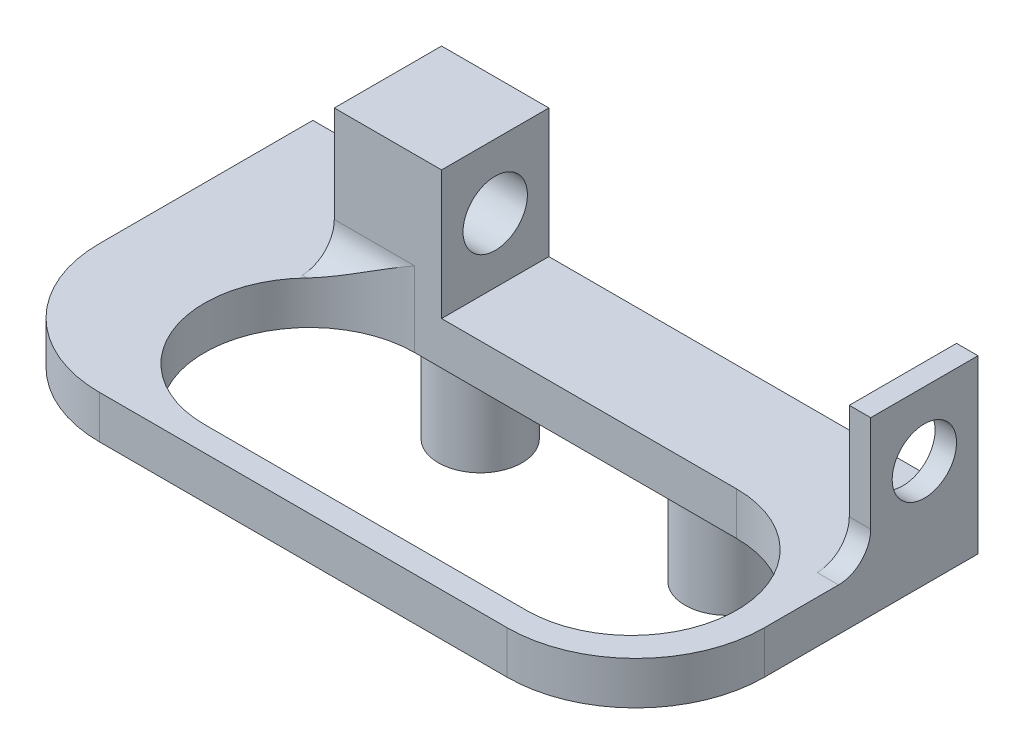
ISO-10303-21;
HEADER;
FILE_DESCRIPTION(('STEP AP214'),'2;1');
FILE_NAME('part.step','',(''),(''),'','','');
FILE_SCHEMA(('AUTOMOTIVE_DESIGN { 1 0 10303 214 1 1 1 1 }'));
ENDSEC;
DATA;
#1=APPLICATION_CONTEXT('core data for automotive mechanical design processes');
#2=APPLICATION_PROTOCOL_DEFINITION('international standard','automotive_design',2000,#1);
#3=PRODUCT_CONTEXT('',#1,'mechanical');
#4=PRODUCT('Part','Part','',(#3));
#5=PRODUCT_RELATED_PRODUCT_CATEGORY('part','',(#4));
#6=PRODUCT_DEFINITION_FORMATION('','',#4);
#7=PRODUCT_DEFINITION_CONTEXT('part definition',#1,'design');
#8=PRODUCT_DEFINITION('design','',#6,#7);
#9=PRODUCT_DEFINITION_SHAPE('','',#8);
#10=(LENGTH_UNIT() NAMED_UNIT(*) SI_UNIT(.MILLI.,.METRE.));
#11=(NAMED_UNIT(*) PLANE_ANGLE_UNIT() SI_UNIT($,.RADIAN.));
#12=(NAMED_UNIT(*) SI_UNIT($,.STERADIAN.) SOLID_ANGLE_UNIT());
#13=UNCERTAINTY_MEASURE_WITH_UNIT(LENGTH_MEASURE(1.E-05),#10,'distance_accuracy_value','');
#14=(GEOMETRIC_REPRESENTATION_CONTEXT(3) GLOBAL_UNCERTAINTY_ASSIGNED_CONTEXT((#13)) GLOBAL_UNIT_ASSIGNED_CONTEXT((#10,
#11,#12)) REPRESENTATION_CONTEXT('',''));
#15=CARTESIAN_POINT('',(0.,0.,0.));
#16=DIRECTION('',(0.,0.,1.));
#17=DIRECTION('',(1.,0.,0.));
#18=AXIS2_PLACEMENT_3D('',#15,#16,#17);
#19=CARTESIAN_POINT('',(0.,2.,0.));
#20=DIRECTION('',(0.,1.,0.));
#21=DIRECTION('',(0.,0.,1.));
#22=AXIS2_PLACEMENT_3D('',#19,#20,#21);
#23=PLANE('',#22);
#24=DIRECTION('',(0.,0.,-1.));
#25=VECTOR('',#24,1.);
#26=CARTESIAN_POINT('',(21.25,2.,-1.95));
#27=LINE('',#26,#25);
#28=CARTESIAN_POINT('',(21.25,2.,8.));
#29=VERTEX_POINT('',#28);
#30=CARTESIAN_POINT('',(21.25,2.,4.55));
#31=VERTEX_POINT('',#30);
#32=EDGE_CURVE('E372',#29,#31,#27,.T.);
#33=ORIENTED_EDGE('',*,*,#32,.T.);
#34=DIRECTION('',(1.,0.,0.));
#35=VECTOR('',#34,1.);
#36=CARTESIAN_POINT('',(0.,2.,4.55000000000001));
#37=LINE('',#36,#35);
#38=CARTESIAN_POINT('',(20.25,2.,4.55));
#39=VERTEX_POINT('',#38);
#40=EDGE_CURVE('E444',#31,#39,#37,.F.);
#41=ORIENTED_EDGE('',*,*,#40,.T.);
#42=DIRECTION('',(0.,0.,1.));
#43=VECTOR('',#42,1.);
#44=CARTESIAN_POINT('',(20.25,2.,-1.95));
#45=LINE('',#44,#43);
#46=CARTESIAN_POINT('',(20.25,2.,-1.95));
#47=VERTEX_POINT('',#46);
#48=EDGE_CURVE('E227',#47,#39,#45,.T.);
#49=ORIENTED_EDGE('',*,*,#48,.F.);
#50=DIRECTION('',(-1.,0.,0.));
#51=VECTOR('',#50,1.);
#52=CARTESIAN_POINT('',(-9.75,2.,-1.95));
#53=LINE('',#52,#51);
#54=CARTESIAN_POINT('',(1.25,2.,-1.95));
#55=VERTEX_POINT('',#54);
#56=EDGE_CURVE('E377',#47,#55,#53,.T.);
#57=ORIENTED_EDGE('',*,*,#56,.T.);
#58=DIRECTION('',(0.,0.,-1.));
#59=VECTOR('',#58,1.);
#60=CARTESIAN_POINT('',(1.25,2.,-1.95));
#61=LINE('',#60,#59);
#62=CARTESIAN_POINT('',(1.25,2.,3.05));
#63=VERTEX_POINT('',#62);
#64=EDGE_CURVE('E248',#63,#55,#61,.T.);
#65=ORIENTED_EDGE('',*,*,#64,.F.);
#66=DIRECTION('',(1.,0.,0.));
#67=VECTOR('',#66,1.);
#68=CARTESIAN_POINT('',(0.,2.,3.05));
#69=LINE('',#68,#67);
#70=CARTESIAN_POINT('',(15.,2.,3.05));
#71=VERTEX_POINT('',#70);
#72=EDGE_CURVE('E318',#63,#71,#69,.T.);
#73=ORIENTED_EDGE('',*,*,#72,.T.);
#74=CARTESIAN_POINT('',(15.,2.,7.95));
#75=DIRECTION('',(0.,-1.,0.));
#76=DIRECTION('',(0.,0.,-1.));
#77=AXIS2_PLACEMENT_3D('',#74,#75,#76);
#78=CIRCLE('',#77,4.9);
#79=CARTESIAN_POINT('',(15.,2.,12.85));
#80=VERTEX_POINT('',#79);
#81=EDGE_CURVE('E322',#71,#80,#78,.T.);
#82=ORIENTED_EDGE('',*,*,#81,.T.);
#83=DIRECTION('',(-1.,0.,0.));
#84=VECTOR('',#83,1.);
#85=CARTESIAN_POINT('',(0.,2.,12.85));
#86=LINE('',#85,#84);
#87=CARTESIAN_POINT('',(0.,2.,12.85));
#88=VERTEX_POINT('',#87);
#89=EDGE_CURVE('E326',#80,#88,#86,.T.);
#90=ORIENTED_EDGE('',*,*,#89,.T.);
#91=CARTESIAN_POINT('',(0.,2.,7.95));
#92=DIRECTION('',(0.,-1.,0.));
#93=DIRECTION('',(0.,0.,-1.));
#94=AXIS2_PLACEMENT_3D('',#91,#92,#93);
#95=CIRCLE('',#94,4.9);
#96=CARTESIAN_POINT('',(-3.52845575287547,2.,4.55));
#97=VERTEX_POINT('',#96);
#98=EDGE_CURVE('E314',#88,#97,#95,.T.);
#99=ORIENTED_EDGE('',*,*,#98,.T.);
#100=DIRECTION('',(1.,0.,0.));
#101=VECTOR('',#100,1.);
#102=CARTESIAN_POINT('',(0.,2.,4.55));
#103=LINE('',#102,#101);
#104=CARTESIAN_POINT('',(-3.75,2.,4.55));
#105=VERTEX_POINT('',#104);
#106=EDGE_CURVE('E440',#97,#105,#103,.F.);
#107=ORIENTED_EDGE('',*,*,#106,.T.);
#108=DIRECTION('',(0.,0.,1.));
#109=VECTOR('',#108,1.);
#110=CARTESIAN_POINT('',(-3.75,2.,-1.95));
#111=LINE('',#110,#109);
#112=CARTESIAN_POINT('',(-3.75,2.,-1.95));
#113=VERTEX_POINT('',#112);
#114=EDGE_CURVE('E254',#113,#105,#111,.T.);
#115=ORIENTED_EDGE('',*,*,#114,.F.);
#116=CARTESIAN_POINT('',(-9.75,2.,-1.95));
#117=VERTEX_POINT('',#116);
#118=EDGE_CURVE('E376',#113,#117,#53,.T.);
#119=ORIENTED_EDGE('',*,*,#118,.T.);
#120=DIRECTION('',(0.,0.,1.));
#121=VECTOR('',#120,1.);
#122=CARTESIAN_POINT('',(-9.75,2.,-1.95));
#123=LINE('',#122,#121);
#124=CARTESIAN_POINT('',(-9.75,2.,8.));
#125=VERTEX_POINT('',#124);
#126=EDGE_CURVE('E363',#117,#125,#123,.T.);
#127=ORIENTED_EDGE('',*,*,#126,.T.);
#128=CARTESIAN_POINT('',(-3.75,2.,8.));
#129=DIRECTION('',(0.,1.,0.));
#130=DIRECTION('',(0.,0.,1.));
#131=AXIS2_PLACEMENT_3D('',#128,#129,#130);
#132=CIRCLE('',#131,6.);
#133=CARTESIAN_POINT('',(-3.75,2.,14.));
#134=VERTEX_POINT('',#133);
#135=EDGE_CURVE('E421',#125,#134,#132,.T.);
#136=ORIENTED_EDGE('',*,*,#135,.T.);
#137=DIRECTION('',(1.,0.,0.));
#138=VECTOR('',#137,1.);
#139=CARTESIAN_POINT('',(-9.75,2.,14.));
#140=LINE('',#139,#138);
#141=CARTESIAN_POINT('',(15.25,2.,14.));
#142=VERTEX_POINT('',#141);
#143=EDGE_CURVE('E367',#134,#142,#140,.T.);
#144=ORIENTED_EDGE('',*,*,#143,.T.);
#145=CARTESIAN_POINT('',(15.25,2.,8.));
#146=DIRECTION('',(0.,1.,0.));
#147=DIRECTION('',(0.,0.,1.));
#148=AXIS2_PLACEMENT_3D('',#145,#146,#147);
#149=CIRCLE('',#148,6.);
#150=EDGE_CURVE('E418',#142,#29,#149,.T.);
#151=ORIENTED_EDGE('',*,*,#150,.T.);
#152=EDGE_LOOP('',(#33,#41,#49,#57,#65,#73,#82,#90,#99,#107,#115,#119,#127,#136,#144,#151));
#153=FACE_BOUND('',#152,.T.);
#154=ADVANCED_FACE('F39',(#153),#23,.T.);
#155=CARTESIAN_POINT('',(0.,0.,0.));
#156=DIRECTION('',(0.,1.,0.));
#157=DIRECTION('',(0.,0.,1.));
#158=AXIS2_PLACEMENT_3D('',#155,#156,#157);
#159=PLANE('',#158);
#160=DIRECTION('',(1.,0.,0.));
#161=VECTOR('',#160,1.);
#162=CARTESIAN_POINT('',(0.,0.,3.05));
#163=LINE('',#162,#161);
#164=CARTESIAN_POINT('',(0.,0.,3.05));
#165=VERTEX_POINT('',#164);
#166=CARTESIAN_POINT('',(15.,0.,3.05));
#167=VERTEX_POINT('',#166);
#168=EDGE_CURVE('E332',#165,#167,#163,.T.);
#169=ORIENTED_EDGE('',*,*,#168,.F.);
#170=CARTESIAN_POINT('',(0.,0.,7.95));
#171=DIRECTION('',(0.,-1.,0.));
#172=DIRECTION('',(0.,0.,-1.));
#173=AXIS2_PLACEMENT_3D('',#170,#171,#172);
#174=CIRCLE('',#173,4.9);
#175=CARTESIAN_POINT('',(0.,0.,12.85));
#176=VERTEX_POINT('',#175);
#177=EDGE_CURVE('E313',#176,#165,#174,.T.);
#178=ORIENTED_EDGE('',*,*,#177,.F.);
#179=DIRECTION('',(-1.,0.,0.));
#180=VECTOR('',#179,1.);
#181=CARTESIAN_POINT('',(0.,0.,12.85));
#182=LINE('',#181,#180);
#183=CARTESIAN_POINT('',(15.,0.,12.85));
#184=VERTEX_POINT('',#183);
#185=EDGE_CURVE('E319',#184,#176,#182,.T.);
#186=ORIENTED_EDGE('',*,*,#185,.F.);
#187=CARTESIAN_POINT('',(15.,0.,7.95));
#188=DIRECTION('',(0.,-1.,0.));
#189=DIRECTION('',(0.,0.,-1.));
#190=AXIS2_PLACEMENT_3D('',#187,#188,#189);
#191=CIRCLE('',#190,4.9);
#192=EDGE_CURVE('E336',#167,#184,#191,.T.);
#193=ORIENTED_EDGE('',*,*,#192,.F.);
#194=EDGE_LOOP('',(#169,#178,#186,#193));
#195=FACE_BOUND('',#194,.T.);
#196=DIRECTION('',(-1.,0.,0.));
#197=VECTOR('',#196,1.);
#198=CARTESIAN_POINT('',(0.,0.,1.95));
#199=LINE('',#198,#197);
#200=CARTESIAN_POINT('',(11.5,0.,1.95));
#201=VERTEX_POINT('',#200);
#202=CARTESIAN_POINT('',(0.,0.,1.95));
#203=VERTEX_POINT('',#202);
#204=EDGE_CURVE('E283',#201,#203,#199,.T.);
#205=ORIENTED_EDGE('',*,*,#204,.F.);
#206=CARTESIAN_POINT('',(11.5,0.,0.));
#207=DIRECTION('',(0.,1.,0.));
#208=DIRECTION('',(0.,0.,1.));
#209=AXIS2_PLACEMENT_3D('',#206,#207,#208);
#210=CIRCLE('',#209,1.95);
#211=CARTESIAN_POINT('',(11.5,0.,-1.95));
#212=VERTEX_POINT('',#211);
#213=EDGE_CURVE('E346',#201,#212,#210,.T.);
#214=ORIENTED_EDGE('',*,*,#213,.T.);
#215=DIRECTION('',(-1.,0.,0.));
#216=VECTOR('',#215,1.);
#217=CARTESIAN_POINT('',(-9.75,0.,-1.95));
#218=LINE('',#217,#216);
#219=CARTESIAN_POINT('',(21.25,0.,-1.95));
#220=VERTEX_POINT('',#219);
#221=EDGE_CURVE('E368',#220,#212,#218,.T.);
#222=ORIENTED_EDGE('',*,*,#221,.F.);
#223=DIRECTION('',(0.,0.,-1.));
#224=VECTOR('',#223,1.);
#225=CARTESIAN_POINT('',(21.25,0.,-1.95));
#226=LINE('',#225,#224);
#227=CARTESIAN_POINT('',(21.25,0.,8.));
#228=VERTEX_POINT('',#227);
#229=EDGE_CURVE('E204',#228,#220,#226,.T.);
#230=ORIENTED_EDGE('',*,*,#229,.F.);
#231=CARTESIAN_POINT('',(15.25,0.,8.));
#232=DIRECTION('',(0.,1.,0.));
#233=DIRECTION('',(0.,0.,1.));
#234=AXIS2_PLACEMENT_3D('',#231,#232,#233);
#235=CIRCLE('',#234,6.);
#236=CARTESIAN_POINT('',(15.25,0.,14.));
#237=VERTEX_POINT('',#236);
#238=EDGE_CURVE('E409',#228,#237,#235,.F.);
#239=ORIENTED_EDGE('',*,*,#238,.T.);
#240=DIRECTION('',(1.,0.,0.));
#241=VECTOR('',#240,1.);
#242=CARTESIAN_POINT('',(-9.75,0.,14.));
#243=LINE('',#242,#241);
#244=CARTESIAN_POINT('',(-3.75,0.,14.));
#245=VERTEX_POINT('',#244);
#246=EDGE_CURVE('E383',#245,#237,#243,.T.);
#247=ORIENTED_EDGE('',*,*,#246,.F.);
#248=CARTESIAN_POINT('',(-3.75,0.,8.));
#249=DIRECTION('',(0.,1.,0.));
#250=DIRECTION('',(0.,0.,1.));
#251=AXIS2_PLACEMENT_3D('',#248,#249,#250);
#252=CIRCLE('',#251,6.);
#253=CARTESIAN_POINT('',(-9.75,0.,8.));
#254=VERTEX_POINT('',#253);
#255=EDGE_CURVE('E412',#245,#254,#252,.F.);
#256=ORIENTED_EDGE('',*,*,#255,.T.);
#257=DIRECTION('',(0.,0.,1.));
#258=VECTOR('',#257,1.);
#259=CARTESIAN_POINT('',(-9.75,0.,-1.95));
#260=LINE('',#259,#258);
#261=CARTESIAN_POINT('',(-9.75,0.,-1.95));
#262=VERTEX_POINT('',#261);
#263=EDGE_CURVE('E359',#262,#254,#260,.T.);
#264=ORIENTED_EDGE('',*,*,#263,.F.);
#265=CARTESIAN_POINT('',(0.,0.,-1.95));
#266=VERTEX_POINT('',#265);
#267=EDGE_CURVE('E389',#266,#262,#218,.T.);
#268=ORIENTED_EDGE('',*,*,#267,.F.);
#269=CARTESIAN_POINT('',(0.,0.,0.));
#270=DIRECTION('',(0.,1.,0.));
#271=DIRECTION('',(0.,0.,1.));
#272=AXIS2_PLACEMENT_3D('',#269,#270,#271);
#273=CIRCLE('',#272,1.95);
#274=EDGE_CURVE('E209',#266,#203,#273,.T.);
#275=ORIENTED_EDGE('',*,*,#274,.T.);
#276=EDGE_LOOP('',(#205,#214,#222,#230,#239,#247,#256,#264,#268,#275));
#277=FACE_BOUND('',#276,.T.);
#278=ADVANCED_FACE('F481',(#195,#277),#159,.F.);
#279=CARTESIAN_POINT('',(0.,-5.,0.));
#280=DIRECTION('',(0.,1.,0.));
#281=DIRECTION('',(0.,0.,1.));
#282=AXIS2_PLACEMENT_3D('',#279,#280,#281);
#283=CYLINDRICAL_SURFACE('',#282,1.95);
#284=CARTESIAN_POINT('',(0.,-1.,0.));
#285=DIRECTION('',(0.,-1.,0.));
#286=DIRECTION('',(0.,0.,-1.));
#287=AXIS2_PLACEMENT_3D('',#284,#285,#286);
#288=CIRCLE('',#287,1.95);
#289=CARTESIAN_POINT('',(0.,-1.,1.95));
#290=VERTEX_POINT('',#289);
#291=CARTESIAN_POINT('',(0.,-1.,-1.95));
#292=VERTEX_POINT('',#291);
#293=EDGE_CURVE('E309',#290,#292,#288,.F.);
#294=ORIENTED_EDGE('',*,*,#293,.F.);
#295=DIRECTION('',(0.,1.,0.));
#296=VECTOR('',#295,1.);
#297=CARTESIAN_POINT('',(0.,-1.,1.95));
#298=LINE('',#297,#296);
#299=EDGE_CURVE('E292',#290,#203,#298,.T.);
#300=ORIENTED_EDGE('',*,*,#299,.T.);
#301=ORIENTED_EDGE('',*,*,#274,.F.);
#302=DIRECTION('',(0.,1.,0.));
#303=VECTOR('',#302,1.);
#304=CARTESIAN_POINT('',(0.,-1.,-1.95));
#305=LINE('',#304,#303);
#306=EDGE_CURVE('E305',#292,#266,#305,.T.);
#307=ORIENTED_EDGE('',*,*,#306,.F.);
#308=EDGE_LOOP('',(#294,#300,#301,#307));
#309=FACE_BOUND('',#308,.T.);
#310=CARTESIAN_POINT('',(0.,-5.,0.));
#311=DIRECTION('',(0.,1.,0.));
#312=DIRECTION('',(0.,0.,1.));
#313=AXIS2_PLACEMENT_3D('',#310,#311,#312);
#314=CIRCLE('',#313,1.95);
#315=CARTESIAN_POINT('',(0.,-5.,1.95));
#316=VERTEX_POINT('',#315);
#317=EDGE_CURVE('E395',#316,#316,#314,.T.);
#318=ORIENTED_EDGE('',*,*,#317,.T.);
#319=EDGE_LOOP('',(#318));
#320=FACE_BOUND('',#319,.T.);
#321=ADVANCED_FACE('F485',(#309,#320),#283,.T.);
#322=CARTESIAN_POINT('',(0.,-5.,0.));
#323=DIRECTION('',(0.,1.,0.));
#324=DIRECTION('',(0.,0.,1.));
#325=AXIS2_PLACEMENT_3D('',#322,#323,#324);
#326=PLANE('',#325);
#327=ORIENTED_EDGE('',*,*,#317,.F.);
#328=EDGE_LOOP('',(#327));
#329=FACE_BOUND('',#328,.T.);
#330=ADVANCED_FACE('F499',(#329),#326,.F.);
#331=CARTESIAN_POINT('',(-9.75,2.,-1.95));
#332=DIRECTION('',(1.,0.,0.));
#333=DIRECTION('',(0.,0.,-1.));
#334=AXIS2_PLACEMENT_3D('',#331,#332,#333);
#335=PLANE('',#334);
#336=ORIENTED_EDGE('',*,*,#263,.T.);
#337=DIRECTION('',(0.,-1.,0.));
#338=VECTOR('',#337,1.);
#339=CARTESIAN_POINT('',(-9.75,2.,8.));
#340=LINE('',#339,#338);
#341=EDGE_CURVE('E415',#254,#125,#340,.F.);
#342=ORIENTED_EDGE('',*,*,#341,.T.);
#343=ORIENTED_EDGE('',*,*,#126,.F.);
#344=DIRECTION('',(0.,-1.,0.));
#345=VECTOR('',#344,1.);
#346=CARTESIAN_POINT('',(-9.75,2.,-1.95));
#347=LINE('',#346,#345);
#348=EDGE_CURVE('E210',#117,#262,#347,.T.);
#349=ORIENTED_EDGE('',*,*,#348,.T.);
#350=EDGE_LOOP('',(#336,#342,#343,#349));
#351=FACE_BOUND('',#350,.T.);
#352=ADVANCED_FACE('F495',(#351),#335,.F.);
#353=CARTESIAN_POINT('',(-9.75,2.,14.));
#354=DIRECTION('',(0.,0.,-1.));
#355=DIRECTION('',(-1.,0.,0.));
#356=AXIS2_PLACEMENT_3D('',#353,#354,#355);
#357=PLANE('',#356);
#358=ORIENTED_EDGE('',*,*,#143,.F.);
#359=DIRECTION('',(0.,-1.,0.));
#360=VECTOR('',#359,1.);
#361=CARTESIAN_POINT('',(-3.75,2.,14.));
#362=LINE('',#361,#360);
#363=EDGE_CURVE('E405',#134,#245,#362,.T.);
#364=ORIENTED_EDGE('',*,*,#363,.T.);
#365=ORIENTED_EDGE('',*,*,#246,.T.);
#366=DIRECTION('',(0.,-1.,0.));
#367=VECTOR('',#366,1.);
#368=CARTESIAN_POINT('',(15.25,2.,14.));
#369=LINE('',#368,#367);
#370=EDGE_CURVE('E399',#237,#142,#369,.F.);
#371=ORIENTED_EDGE('',*,*,#370,.T.);
#372=EDGE_LOOP('',(#358,#364,#365,#371));
#373=FACE_BOUND('',#372,.T.);
#374=ADVANCED_FACE('F491',(#373),#357,.F.);
#375=CARTESIAN_POINT('',(21.25,2.,-1.95));
#376=DIRECTION('',(-1.,0.,0.));
#377=DIRECTION('',(0.,0.,1.));
#378=AXIS2_PLACEMENT_3D('',#375,#376,#377);
#379=PLANE('',#378);
#380=CARTESIAN_POINT('',(21.25,5.,0.549999999999997));
#381=DIRECTION('',(-1.,0.,0.));
#382=DIRECTION('',(0.,0.,1.));
#383=AXIS2_PLACEMENT_3D('',#380,#381,#382);
#384=CIRCLE('',#383,1.5);
#385=CARTESIAN_POINT('',(21.25,5.,2.05));
#386=VERTEX_POINT('',#385);
#387=EDGE_CURVE('E436',#386,#386,#384,.T.);
#388=ORIENTED_EDGE('',*,*,#387,.T.);
#389=EDGE_LOOP('',(#388));
#390=FACE_BOUND('',#389,.T.);
#391=ORIENTED_EDGE('',*,*,#32,.F.);
#392=DIRECTION('',(0.,-1.,0.));
#393=VECTOR('',#392,1.);
#394=CARTESIAN_POINT('',(21.25,2.,8.));
#395=LINE('',#394,#393);
#396=EDGE_CURVE('E424',#29,#228,#395,.T.);
#397=ORIENTED_EDGE('',*,*,#396,.T.);
#398=ORIENTED_EDGE('',*,*,#229,.T.);
#399=DIRECTION('',(0.,-1.,0.));
#400=VECTOR('',#399,1.);
#401=CARTESIAN_POINT('',(21.25,2.,-1.95));
#402=LINE('',#401,#400);
#403=CARTESIAN_POINT('',(21.25,8.,-1.95));
#404=VERTEX_POINT('',#403);
#405=EDGE_CURVE('E195',#404,#220,#402,.T.);
#406=ORIENTED_EDGE('',*,*,#405,.F.);
#407=DIRECTION('',(0.,0.,-1.));
#408=VECTOR('',#407,1.);
#409=CARTESIAN_POINT('',(21.25,8.,-1.95));
#410=LINE('',#409,#408);
#411=CARTESIAN_POINT('',(21.25,8.,3.05));
#412=VERTEX_POINT('',#411);
#413=EDGE_CURVE('E201',#412,#404,#410,.T.);
#414=ORIENTED_EDGE('',*,*,#413,.F.);
#415=DIRECTION('',(0.,-1.,0.));
#416=VECTOR('',#415,1.);
#417=CARTESIAN_POINT('',(21.25,8.,3.05));
#418=LINE('',#417,#416);
#419=CARTESIAN_POINT('',(21.25,3.5,3.05));
#420=VERTEX_POINT('',#419);
#421=EDGE_CURVE('E238',#412,#420,#418,.T.);
#422=ORIENTED_EDGE('',*,*,#421,.T.);
#423=CARTESIAN_POINT('',(21.25,3.5,4.55));
#424=DIRECTION('',(-1.,0.,0.));
#425=DIRECTION('',(0.,0.,1.));
#426=AXIS2_PLACEMENT_3D('',#423,#424,#425);
#427=CIRCLE('',#426,1.5);
#428=EDGE_CURVE('E452',#420,#31,#427,.T.);
#429=ORIENTED_EDGE('',*,*,#428,.T.);
#430=EDGE_LOOP('',(#391,#397,#398,#406,#414,#422,#429));
#431=FACE_BOUND('',#430,.T.);
#432=ADVANCED_FACE('F198',(#390,#431),#379,.F.);
#433=CARTESIAN_POINT('',(-9.75,2.,-1.95));
#434=DIRECTION('',(0.,0.,1.));
#435=DIRECTION('',(1.,0.,0.));
#436=AXIS2_PLACEMENT_3D('',#433,#434,#435);
#437=PLANE('',#436);
#438=ORIENTED_EDGE('',*,*,#221,.T.);
#439=DIRECTION('',(0.,1.,0.));
#440=VECTOR('',#439,1.);
#441=CARTESIAN_POINT('',(11.5,-1.,-1.95));
#442=LINE('',#441,#440);
#443=CARTESIAN_POINT('',(11.5,-1.,-1.95));
#444=VERTEX_POINT('',#443);
#445=EDGE_CURVE('E302',#444,#212,#442,.T.);
#446=ORIENTED_EDGE('',*,*,#445,.F.);
#447=DIRECTION('',(1.,0.,0.));
#448=VECTOR('',#447,1.);
#449=CARTESIAN_POINT('',(0.,-1.,-1.95));
#450=LINE('',#449,#448);
#451=EDGE_CURVE('E284',#292,#444,#450,.T.);
#452=ORIENTED_EDGE('',*,*,#451,.F.);
#453=ORIENTED_EDGE('',*,*,#306,.T.);
#454=ORIENTED_EDGE('',*,*,#267,.T.);
#455=ORIENTED_EDGE('',*,*,#348,.F.);
#456=ORIENTED_EDGE('',*,*,#118,.F.);
#457=DIRECTION('',(0.,-1.,0.));
#458=VECTOR('',#457,1.);
#459=CARTESIAN_POINT('',(-3.75,8.,-1.95));
#460=LINE('',#459,#458);
#461=CARTESIAN_POINT('',(-3.75,8.,-1.95));
#462=VERTEX_POINT('',#461);
#463=EDGE_CURVE('E275',#462,#113,#460,.T.);
#464=ORIENTED_EDGE('',*,*,#463,.F.);
#465=DIRECTION('',(-1.,0.,0.));
#466=VECTOR('',#465,1.);
#467=CARTESIAN_POINT('',(-3.75,8.,-1.95));
#468=LINE('',#467,#466);
#469=CARTESIAN_POINT('',(1.25,8.,-1.95));
#470=VERTEX_POINT('',#469);
#471=EDGE_CURVE('E253',#470,#462,#468,.T.);
#472=ORIENTED_EDGE('',*,*,#471,.F.);
#473=DIRECTION('',(0.,-1.,0.));
#474=VECTOR('',#473,1.);
#475=CARTESIAN_POINT('',(1.25,8.,-1.95));
#476=LINE('',#475,#474);
#477=EDGE_CURVE('E279',#470,#55,#476,.T.);
#478=ORIENTED_EDGE('',*,*,#477,.T.);
#479=ORIENTED_EDGE('',*,*,#56,.F.);
#480=DIRECTION('',(0.,-1.,0.));
#481=VECTOR('',#480,1.);
#482=CARTESIAN_POINT('',(20.25,8.,-1.95));
#483=LINE('',#482,#481);
#484=CARTESIAN_POINT('',(20.25,8.,-1.95));
#485=VERTEX_POINT('',#484);
#486=EDGE_CURVE('E216',#485,#47,#483,.T.);
#487=ORIENTED_EDGE('',*,*,#486,.F.);
#488=DIRECTION('',(-1.,0.,0.));
#489=VECTOR('',#488,1.);
#490=CARTESIAN_POINT('',(21.25,8.,-1.95));
#491=LINE('',#490,#489);
#492=EDGE_CURVE('E213',#404,#485,#491,.T.);
#493=ORIENTED_EDGE('',*,*,#492,.F.);
#494=ORIENTED_EDGE('',*,*,#405,.T.);
#495=EDGE_LOOP('',(#438,#446,#452,#453,#454,#455,#456,#464,#472,#478,#479,#487,#493,#494));
#496=FACE_BOUND('',#495,.T.);
#497=ADVANCED_FACE('F214',(#496),#437,.F.);
#498=CARTESIAN_POINT('',(11.5,-5.,0.));
#499=DIRECTION('',(0.,1.,0.));
#500=DIRECTION('',(0.,0.,1.));
#501=AXIS2_PLACEMENT_3D('',#498,#499,#500);
#502=CYLINDRICAL_SURFACE('',#501,1.95);
#503=CARTESIAN_POINT('',(11.5,-1.,0.));
#504=DIRECTION('',(0.,-1.,0.));
#505=DIRECTION('',(0.,0.,-1.));
#506=AXIS2_PLACEMENT_3D('',#503,#504,#505);
#507=CIRCLE('',#506,1.95);
#508=CARTESIAN_POINT('',(11.5,-1.,1.95));
#509=VERTEX_POINT('',#508);
#510=EDGE_CURVE('E427',#444,#509,#507,.F.);
#511=ORIENTED_EDGE('',*,*,#510,.F.);
#512=ORIENTED_EDGE('',*,*,#445,.T.);
#513=ORIENTED_EDGE('',*,*,#213,.F.);
#514=DIRECTION('',(0.,1.,0.));
#515=VECTOR('',#514,1.);
#516=CARTESIAN_POINT('',(11.5,-1.,1.95));
#517=LINE('',#516,#515);
#518=EDGE_CURVE('E298',#509,#201,#517,.T.);
#519=ORIENTED_EDGE('',*,*,#518,.F.);
#520=EDGE_LOOP('',(#511,#512,#513,#519));
#521=FACE_BOUND('',#520,.T.);
#522=CARTESIAN_POINT('',(11.5,-5.,0.));
#523=DIRECTION('',(0.,1.,0.));
#524=DIRECTION('',(0.,0.,1.));
#525=AXIS2_PLACEMENT_3D('',#522,#523,#524);
#526=CIRCLE('',#525,1.95);
#527=CARTESIAN_POINT('',(11.5,-5.,1.95));
#528=VERTEX_POINT('',#527);
#529=EDGE_CURVE('E355',#528,#528,#526,.T.);
#530=ORIENTED_EDGE('',*,*,#529,.T.);
#531=EDGE_LOOP('',(#530));
#532=FACE_BOUND('',#531,.T.);
#533=ADVANCED_FACE('F474',(#521,#532),#502,.T.);
#534=CARTESIAN_POINT('',(11.5,-5.,0.));
#535=DIRECTION('',(0.,1.,0.));
#536=DIRECTION('',(0.,0.,1.));
#537=AXIS2_PLACEMENT_3D('',#534,#535,#536);
#538=PLANE('',#537);
#539=ORIENTED_EDGE('',*,*,#529,.F.);
#540=EDGE_LOOP('',(#539));
#541=FACE_BOUND('',#540,.T.);
#542=ADVANCED_FACE('F469',(#541),#538,.F.);
#543=CARTESIAN_POINT('',(0.,2.,7.95));
#544=DIRECTION('',(0.,-1.,0.));
#545=DIRECTION('',(0.,0.,-1.));
#546=AXIS2_PLACEMENT_3D('',#543,#544,#545);
#547=CYLINDRICAL_SURFACE('',#546,4.9);
#548=ORIENTED_EDGE('',*,*,#177,.T.);
#549=DIRECTION('',(0.,-1.,0.));
#550=VECTOR('',#549,1.);
#551=CARTESIAN_POINT('',(0.,2.,3.05));
#552=LINE('',#551,#550);
#553=CARTESIAN_POINT('',(0.,3.5,3.05));
#554=VERTEX_POINT('',#553);
#555=EDGE_CURVE('E56',#554,#165,#552,.T.);
#556=ORIENTED_EDGE('',*,*,#555,.F.);
#557=CARTESIAN_POINT('',(-3.52845575287547,2.,4.55));
#558=CARTESIAN_POINT('',(-3.47124686235083,2.00001897517144,4.49060989517951));
#559=CARTESIAN_POINT('',(-3.4125740210223,2.00352441799923,4.43273913418979));
#560=CARTESIAN_POINT('',(-3.2928644894716,2.01659084892399,4.32043677753349));
#561=CARTESIAN_POINT('',(-3.23183254142291,2.0261402272424,4.26599880779665));
#562=CARTESIAN_POINT('',(-3.10832247231625,2.05027157995227,4.16122160713046));
#563=CARTESIAN_POINT('',(-3.04586304557321,2.06480599340915,4.11084900663899));
#564=CARTESIAN_POINT('',(-2.91926073717073,2.09819946963921,4.01372185674668));
#565=CARTESIAN_POINT('',(-2.85511678577182,2.11706134235372,3.9669696846904));
#566=CARTESIAN_POINT('',(-2.69402257294216,2.16850059704033,3.85537519910281));
#567=CARTESIAN_POINT('',(-2.59624010911776,2.20329468040417,3.79274773088862));
#568=CARTESIAN_POINT('',(-2.39837969299687,2.27926319914186,3.67553992589143));
#569=CARTESIAN_POINT('',(-2.29830109258334,2.32043945533006,3.62096189428703));
#570=CARTESIAN_POINT('',(-2.09581382786251,2.40806149036013,3.51937176126222));
#571=CARTESIAN_POINT('',(-1.99339508063913,2.45453618275599,3.47240492604178));
#572=CARTESIAN_POINT('',(-1.78719165381548,2.55145677900529,3.3861812494173));
#573=CARTESIAN_POINT('',(-1.68340661674901,2.60190374005043,3.34692647030493));
#574=CARTESIAN_POINT('',(-1.45026673864445,2.71808387322276,3.26756001967913));
#575=CARTESIAN_POINT('',(-1.32063837861557,2.78462197152916,3.22941774564561));
#576=CARTESIAN_POINT('',(-1.06033310830424,2.92093270486974,3.16421729238416));
#577=CARTESIAN_POINT('',(-0.929655870695369,2.99070638489315,3.13716272227583));
#578=CARTESIAN_POINT('',(-0.537400104329237,3.20268796837043,3.07237239340505));
#579=CARTESIAN_POINT('',(-0.274581567482306,3.34807892787029,3.05067079068893));
#580=CARTESIAN_POINT('',(-0.00816654927550851,3.49548159102908,3.05000510935682));
#581=CARTESIAN_POINT('',(-0.0040832115961563,3.49774083400292,3.05000000566737));
#582=CARTESIAN_POINT('',(0.,3.5,3.05));
#583=B_SPLINE_CURVE_WITH_KNOTS('',3,(#557,#558,#559,#560,#561,#562,#563,#564,#565,#566,#567,
#568,#569,#570,#571,#572,#573,#574,#575,#576,#577,#578,#579,#580,#581,#582),.UNSPECIFIED.,.F.,
.F.,(4,2,2,2,2,2,2,2,2,2,2,2,4),(0.,0.247174373704576,0.493875385915299,0.738285304929291,
0.98285437761882,1.3459612109324,1.70917182884497,2.07446902888388,2.43986378098972,
2.89118696620831,3.34265694359366,4.24205303585392,4.25605304424118),.UNSPECIFIED.);
#584=EDGE_CURVE('E49',#554,#97,#583,.F.);
#585=ORIENTED_EDGE('',*,*,#584,.T.);
#586=ORIENTED_EDGE('',*,*,#98,.F.);
#587=DIRECTION('',(0.,-1.,0.));
#588=VECTOR('',#587,1.);
#589=CARTESIAN_POINT('',(0.,2.,12.85));
#590=LINE('',#589,#588);
#591=EDGE_CURVE('E343',#88,#176,#590,.T.);
#592=ORIENTED_EDGE('',*,*,#591,.T.);
#593=EDGE_LOOP('',(#548,#556,#585,#586,#592));
#594=FACE_BOUND('',#593,.T.);
#595=ADVANCED_FACE('F463',(#594),#547,.F.);
#596=CARTESIAN_POINT('',(0.,2.,12.85));
#597=DIRECTION('',(0.,0.,1.));
#598=DIRECTION('',(1.,0.,0.));
#599=AXIS2_PLACEMENT_3D('',#596,#597,#598);
#600=PLANE('',#599);
#601=ORIENTED_EDGE('',*,*,#185,.T.);
#602=ORIENTED_EDGE('',*,*,#591,.F.);
#603=ORIENTED_EDGE('',*,*,#89,.F.);
#604=DIRECTION('',(0.,-1.,0.));
#605=VECTOR('',#604,1.);
#606=CARTESIAN_POINT('',(15.,2.,12.85));
#607=LINE('',#606,#605);
#608=EDGE_CURVE('E347',#80,#184,#607,.T.);
#609=ORIENTED_EDGE('',*,*,#608,.T.);
#610=EDGE_LOOP('',(#601,#602,#603,#609));
#611=FACE_BOUND('',#610,.T.);
#612=ADVANCED_FACE('F468',(#611),#600,.F.);
#613=CARTESIAN_POINT('',(15.,2.,7.95));
#614=DIRECTION('',(0.,-1.,0.));
#615=DIRECTION('',(0.,0.,-1.));
#616=AXIS2_PLACEMENT_3D('',#613,#614,#615);
#617=CYLINDRICAL_SURFACE('',#616,4.9);
#618=ORIENTED_EDGE('',*,*,#192,.T.);
#619=ORIENTED_EDGE('',*,*,#608,.F.);
#620=ORIENTED_EDGE('',*,*,#81,.F.);
#621=DIRECTION('',(0.,-1.,0.));
#622=VECTOR('',#621,1.);
#623=CARTESIAN_POINT('',(15.,2.,3.05));
#624=LINE('',#623,#622);
#625=EDGE_CURVE('E350',#71,#167,#624,.T.);
#626=ORIENTED_EDGE('',*,*,#625,.T.);
#627=EDGE_LOOP('',(#618,#619,#620,#626));
#628=FACE_BOUND('',#627,.T.);
#629=ADVANCED_FACE('F579',(#628),#617,.F.);
#630=CARTESIAN_POINT('',(0.,2.,3.05));
#631=DIRECTION('',(0.,0.,-1.));
#632=DIRECTION('',(-1.,0.,0.));
#633=AXIS2_PLACEMENT_3D('',#630,#631,#632);
#634=PLANE('',#633);
#635=DIRECTION('',(0.,-1.,0.));
#636=VECTOR('',#635,1.);
#637=CARTESIAN_POINT('',(-3.75,8.,3.05));
#638=LINE('',#637,#636);
#639=CARTESIAN_POINT('',(-3.75,8.,3.05));
#640=VERTEX_POINT('',#639);
#641=CARTESIAN_POINT('',(-3.75,3.5,3.05));
#642=VERTEX_POINT('',#641);
#643=EDGE_CURVE('E272',#640,#642,#638,.T.);
#644=ORIENTED_EDGE('',*,*,#643,.T.);
#645=DIRECTION('',(1.,0.,0.));
#646=VECTOR('',#645,1.);
#647=CARTESIAN_POINT('',(0.,3.5,3.05));
#648=LINE('',#647,#646);
#649=EDGE_CURVE('E448',#642,#554,#648,.T.);
#650=ORIENTED_EDGE('',*,*,#649,.T.);
#651=ORIENTED_EDGE('',*,*,#555,.T.);
#652=ORIENTED_EDGE('',*,*,#168,.T.);
#653=ORIENTED_EDGE('',*,*,#625,.F.);
#654=ORIENTED_EDGE('',*,*,#72,.F.);
#655=DIRECTION('',(0.,-1.,0.));
#656=VECTOR('',#655,1.);
#657=CARTESIAN_POINT('',(1.25,8.,3.05));
#658=LINE('',#657,#656);
#659=CARTESIAN_POINT('',(1.25,8.,3.05));
#660=VERTEX_POINT('',#659);
#661=EDGE_CURVE('E263',#660,#63,#658,.T.);
#662=ORIENTED_EDGE('',*,*,#661,.F.);
#663=DIRECTION('',(1.,0.,0.));
#664=VECTOR('',#663,1.);
#665=CARTESIAN_POINT('',(-3.75,8.,3.05));
#666=LINE('',#665,#664);
#667=EDGE_CURVE('E260',#640,#660,#666,.T.);
#668=ORIENTED_EDGE('',*,*,#667,.F.);
#669=EDGE_LOOP('',(#644,#650,#651,#652,#653,#654,#662,#668));
#670=FACE_BOUND('',#669,.T.);
#671=ADVANCED_FACE('F470',(#670),#634,.F.);
#672=CARTESIAN_POINT('',(-3.75,2.,8.));
#673=DIRECTION('',(0.,-1.,0.));
#674=DIRECTION('',(0.,0.,-1.));
#675=AXIS2_PLACEMENT_3D('',#672,#673,#674);
#676=CYLINDRICAL_SURFACE('',#675,6.);
#677=ORIENTED_EDGE('',*,*,#135,.F.);
#678=ORIENTED_EDGE('',*,*,#341,.F.);
#679=ORIENTED_EDGE('',*,*,#255,.F.);
#680=ORIENTED_EDGE('',*,*,#363,.F.);
#681=EDGE_LOOP('',(#677,#678,#679,#680));
#682=FACE_BOUND('',#681,.T.);
#683=ADVANCED_FACE('F507',(#682),#676,.T.);
#684=CARTESIAN_POINT('',(15.25,2.,8.));
#685=DIRECTION('',(0.,-1.,0.));
#686=DIRECTION('',(0.,0.,-1.));
#687=AXIS2_PLACEMENT_3D('',#684,#685,#686);
#688=CYLINDRICAL_SURFACE('',#687,6.);
#689=ORIENTED_EDGE('',*,*,#150,.F.);
#690=ORIENTED_EDGE('',*,*,#370,.F.);
#691=ORIENTED_EDGE('',*,*,#238,.F.);
#692=ORIENTED_EDGE('',*,*,#396,.F.);
#693=EDGE_LOOP('',(#689,#690,#691,#692));
#694=FACE_BOUND('',#693,.T.);
#695=ADVANCED_FACE('F510',(#694),#688,.T.);
#696=CARTESIAN_POINT('',(0.,-1.,1.95));
#697=DIRECTION('',(0.,0.,-1.));
#698=DIRECTION('',(-1.,0.,0.));
#699=AXIS2_PLACEMENT_3D('',#696,#697,#698);
#700=PLANE('',#699);
#701=ORIENTED_EDGE('',*,*,#204,.T.);
#702=ORIENTED_EDGE('',*,*,#299,.F.);
#703=DIRECTION('',(-1.,0.,0.));
#704=VECTOR('',#703,1.);
#705=CARTESIAN_POINT('',(0.,-1.,1.95));
#706=LINE('',#705,#704);
#707=EDGE_CURVE('E288',#509,#290,#706,.T.);
#708=ORIENTED_EDGE('',*,*,#707,.F.);
#709=ORIENTED_EDGE('',*,*,#518,.T.);
#710=EDGE_LOOP('',(#701,#702,#708,#709));
#711=FACE_BOUND('',#710,.T.);
#712=ADVANCED_FACE('F513',(#711),#700,.F.);
#713=CARTESIAN_POINT('',(0.,-1.,0.));
#714=DIRECTION('',(0.,-1.,0.));
#715=DIRECTION('',(0.,0.,-1.));
#716=AXIS2_PLACEMENT_3D('',#713,#714,#715);
#717=PLANE('',#716);
#718=ORIENTED_EDGE('',*,*,#707,.T.);
#719=ORIENTED_EDGE('',*,*,#293,.T.);
#720=ORIENTED_EDGE('',*,*,#451,.T.);
#721=ORIENTED_EDGE('',*,*,#510,.T.);
#722=EDGE_LOOP('',(#718,#719,#720,#721));
#723=FACE_BOUND('',#722,.T.);
#724=ADVANCED_FACE('F548',(#723),#717,.T.);
#725=CARTESIAN_POINT('',(1.25,8.,-1.95));
#726=DIRECTION('',(-1.,0.,0.));
#727=DIRECTION('',(0.,0.,1.));
#728=AXIS2_PLACEMENT_3D('',#725,#726,#727);
#729=PLANE('',#728);
#730=CARTESIAN_POINT('',(1.25,5.,0.549999999999999));
#731=DIRECTION('',(-1.,0.,0.));
#732=DIRECTION('',(0.,0.,1.));
#733=AXIS2_PLACEMENT_3D('',#730,#731,#732);
#734=CIRCLE('',#733,1.5);
#735=CARTESIAN_POINT('',(1.25,5.,2.05));
#736=VERTEX_POINT('',#735);
#737=EDGE_CURVE('E230',#736,#736,#734,.T.);
#738=ORIENTED_EDGE('',*,*,#737,.T.);
#739=EDGE_LOOP('',(#738));
#740=FACE_BOUND('',#739,.T.);
#741=ORIENTED_EDGE('',*,*,#64,.T.);
#742=ORIENTED_EDGE('',*,*,#477,.F.);
#743=DIRECTION('',(0.,0.,-1.));
#744=VECTOR('',#743,1.);
#745=CARTESIAN_POINT('',(1.25,8.,-1.95));
#746=LINE('',#745,#744);
#747=EDGE_CURVE('E249',#660,#470,#746,.T.);
#748=ORIENTED_EDGE('',*,*,#747,.F.);
#749=ORIENTED_EDGE('',*,*,#661,.T.);
#750=EDGE_LOOP('',(#741,#742,#748,#749));
#751=FACE_BOUND('',#750,.T.);
#752=ADVANCED_FACE('F571',(#740,#751),#729,.F.);
#753=CARTESIAN_POINT('',(-3.75,8.,-1.95));
#754=DIRECTION('',(1.,0.,0.));
#755=DIRECTION('',(0.,0.,-1.));
#756=AXIS2_PLACEMENT_3D('',#753,#754,#755);
#757=PLANE('',#756);
#758=CARTESIAN_POINT('',(-3.75,5.,0.549999999999999));
#759=DIRECTION('',(-1.,0.,0.));
#760=DIRECTION('',(0.,0.,1.));
#761=AXIS2_PLACEMENT_3D('',#758,#759,#760);
#762=CIRCLE('',#761,1.5);
#763=CARTESIAN_POINT('',(-3.75,5.,2.05));
#764=VERTEX_POINT('',#763);
#765=EDGE_CURVE('E623',#764,#764,#762,.T.);
#766=ORIENTED_EDGE('',*,*,#765,.F.);
#767=EDGE_LOOP('',(#766));
#768=FACE_BOUND('',#767,.T.);
#769=ORIENTED_EDGE('',*,*,#114,.T.);
#770=CARTESIAN_POINT('',(-3.75,3.5,4.55));
#771=DIRECTION('',(1.,0.,0.));
#772=DIRECTION('',(0.,0.,-1.));
#773=AXIS2_PLACEMENT_3D('',#770,#771,#772);
#774=CIRCLE('',#773,1.5);
#775=EDGE_CURVE('E11',#105,#642,#774,.T.);
#776=ORIENTED_EDGE('',*,*,#775,.T.);
#777=ORIENTED_EDGE('',*,*,#643,.F.);
#778=DIRECTION('',(0.,0.,1.));
#779=VECTOR('',#778,1.);
#780=CARTESIAN_POINT('',(-3.75,8.,-1.95));
#781=LINE('',#780,#779);
#782=EDGE_CURVE('E257',#462,#640,#781,.T.);
#783=ORIENTED_EDGE('',*,*,#782,.F.);
#784=ORIENTED_EDGE('',*,*,#463,.T.);
#785=EDGE_LOOP('',(#769,#776,#777,#783,#784));
#786=FACE_BOUND('',#785,.T.);
#787=ADVANCED_FACE('F563',(#768,#786),#757,.F.);
#788=CARTESIAN_POINT('',(0.,8.,0.));
#789=DIRECTION('',(0.,1.,0.));
#790=DIRECTION('',(0.,0.,1.));
#791=AXIS2_PLACEMENT_3D('',#788,#789,#790);
#792=PLANE('',#791);
#793=ORIENTED_EDGE('',*,*,#747,.T.);
#794=ORIENTED_EDGE('',*,*,#471,.T.);
#795=ORIENTED_EDGE('',*,*,#782,.T.);
#796=ORIENTED_EDGE('',*,*,#667,.T.);
#797=EDGE_LOOP('',(#793,#794,#795,#796));
#798=FACE_BOUND('',#797,.T.);
#799=ADVANCED_FACE('F566',(#798),#792,.T.);
#800=CARTESIAN_POINT('',(20.25,8.,-1.95));
#801=DIRECTION('',(1.,0.,0.));
#802=DIRECTION('',(0.,0.,-1.));
#803=AXIS2_PLACEMENT_3D('',#800,#801,#802);
#804=PLANE('',#803);
#805=CARTESIAN_POINT('',(20.25,5.,0.549999999999997));
#806=DIRECTION('',(1.,0.,0.));
#807=DIRECTION('',(0.,0.,-1.));
#808=AXIS2_PLACEMENT_3D('',#805,#806,#807);
#809=CIRCLE('',#808,1.5);
#810=CARTESIAN_POINT('',(20.25,5.,-0.950000000000003));
#811=VERTEX_POINT('',#810);
#812=EDGE_CURVE('E432',#811,#811,#809,.T.);
#813=ORIENTED_EDGE('',*,*,#812,.T.);
#814=EDGE_LOOP('',(#813));
#815=FACE_BOUND('',#814,.T.);
#816=ORIENTED_EDGE('',*,*,#48,.T.);
#817=CARTESIAN_POINT('',(20.25,3.5,4.55));
#818=DIRECTION('',(1.,0.,0.));
#819=DIRECTION('',(0.,0.,-1.));
#820=AXIS2_PLACEMENT_3D('',#817,#818,#819);
#821=CIRCLE('',#820,1.5);
#822=CARTESIAN_POINT('',(20.25,3.5,3.05));
#823=VERTEX_POINT('',#822);
#824=EDGE_CURVE('E455',#39,#823,#821,.T.);
#825=ORIENTED_EDGE('',*,*,#824,.T.);
#826=DIRECTION('',(0.,-1.,0.));
#827=VECTOR('',#826,1.);
#828=CARTESIAN_POINT('',(20.25,8.,3.05));
#829=LINE('',#828,#827);
#830=CARTESIAN_POINT('',(20.25,8.,3.05));
#831=VERTEX_POINT('',#830);
#832=EDGE_CURVE('E242',#831,#823,#829,.T.);
#833=ORIENTED_EDGE('',*,*,#832,.F.);
#834=DIRECTION('',(0.,0.,1.));
#835=VECTOR('',#834,1.);
#836=CARTESIAN_POINT('',(20.25,8.,-1.95));
#837=LINE('',#836,#835);
#838=EDGE_CURVE('E220',#485,#831,#837,.T.);
#839=ORIENTED_EDGE('',*,*,#838,.F.);
#840=ORIENTED_EDGE('',*,*,#486,.T.);
#841=EDGE_LOOP('',(#816,#825,#833,#839,#840));
#842=FACE_BOUND('',#841,.T.);
#843=ADVANCED_FACE('F532',(#815,#842),#804,.F.);
#844=CARTESIAN_POINT('',(21.25,8.,3.05));
#845=DIRECTION('',(0.,0.,-1.));
#846=DIRECTION('',(-1.,0.,0.));
#847=AXIS2_PLACEMENT_3D('',#844,#845,#846);
#848=PLANE('',#847);
#849=ORIENTED_EDGE('',*,*,#832,.T.);
#850=DIRECTION('',(1.,0.,0.));
#851=VECTOR('',#850,1.);
#852=CARTESIAN_POINT('',(21.25,3.5,3.05));
#853=LINE('',#852,#851);
#854=EDGE_CURVE('E431',#823,#420,#853,.T.);
#855=ORIENTED_EDGE('',*,*,#854,.T.);
#856=ORIENTED_EDGE('',*,*,#421,.F.);
#857=DIRECTION('',(1.,0.,0.));
#858=VECTOR('',#857,1.);
#859=CARTESIAN_POINT('',(21.25,8.,3.05));
#860=LINE('',#859,#858);
#861=EDGE_CURVE('E224',#831,#412,#860,.T.);
#862=ORIENTED_EDGE('',*,*,#861,.F.);
#863=EDGE_LOOP('',(#849,#855,#856,#862));
#864=FACE_BOUND('',#863,.T.);
#865=ADVANCED_FACE('F535',(#864),#848,.F.);
#866=CARTESIAN_POINT('',(0.,8.,0.));
#867=DIRECTION('',(0.,-1.,0.));
#868=DIRECTION('',(0.,0.,-1.));
#869=AXIS2_PLACEMENT_3D('',#866,#867,#868);
#870=PLANE('',#869);
#871=ORIENTED_EDGE('',*,*,#413,.T.);
#872=ORIENTED_EDGE('',*,*,#492,.T.);
#873=ORIENTED_EDGE('',*,*,#838,.T.);
#874=ORIENTED_EDGE('',*,*,#861,.T.);
#875=EDGE_LOOP('',(#871,#872,#873,#874));
#876=FACE_BOUND('',#875,.T.);
#877=ADVANCED_FACE('F222',(#876),#870,.F.);
#878=CARTESIAN_POINT('',(21.25,5.,0.549999999999997));
#879=DIRECTION('',(-1.,0.,0.));
#880=DIRECTION('',(0.,0.,1.));
#881=AXIS2_PLACEMENT_3D('',#878,#879,#880);
#882=CYLINDRICAL_SURFACE('',#881,1.5);
#883=ORIENTED_EDGE('',*,*,#387,.F.);
#884=EDGE_LOOP('',(#883));
#885=FACE_BOUND('',#884,.T.);
#886=ORIENTED_EDGE('',*,*,#812,.F.);
#887=EDGE_LOOP('',(#886));
#888=FACE_BOUND('',#887,.T.);
#889=ADVANCED_FACE('F524',(#885,#888),#882,.F.);
#890=ORIENTED_EDGE('',*,*,#765,.T.);
#891=EDGE_LOOP('',(#890));
#892=FACE_BOUND('',#891,.T.);
#893=ORIENTED_EDGE('',*,*,#737,.F.);
#894=EDGE_LOOP('',(#893));
#895=FACE_BOUND('',#894,.T.);
#896=ADVANCED_FACE('F517',(#892,#895),#882,.F.);
#897=CARTESIAN_POINT('',(21.25,3.5,4.55));
#898=DIRECTION('',(1.,0.,0.));
#899=DIRECTION('',(0.,0.,-1.));
#900=AXIS2_PLACEMENT_3D('',#897,#898,#899);
#901=CYLINDRICAL_SURFACE('',#900,1.5);
#902=ORIENTED_EDGE('',*,*,#824,.F.);
#903=ORIENTED_EDGE('',*,*,#40,.F.);
#904=ORIENTED_EDGE('',*,*,#428,.F.);
#905=ORIENTED_EDGE('',*,*,#854,.F.);
#906=EDGE_LOOP('',(#902,#903,#904,#905));
#907=FACE_BOUND('',#906,.T.);
#908=ADVANCED_FACE('F515',(#907),#901,.F.);
#909=CARTESIAN_POINT('',(0.,3.5,4.55));
#910=DIRECTION('',(1.,0.,0.));
#911=DIRECTION('',(0.,0.,-1.));
#912=AXIS2_PLACEMENT_3D('',#909,#910,#911);
#913=CYLINDRICAL_SURFACE('',#912,1.5);
#914=ORIENTED_EDGE('',*,*,#775,.F.);
#915=ORIENTED_EDGE('',*,*,#106,.F.);
#916=ORIENTED_EDGE('',*,*,#584,.F.);
#917=ORIENTED_EDGE('',*,*,#649,.F.);
#918=EDGE_LOOP('',(#914,#915,#916,#917));
#919=FACE_BOUND('',#918,.T.);
#920=ADVANCED_FACE('F41',(#919),#913,.F.);
#921=CLOSED_SHELL('',(#154,#278,#321,#330,#352,#374,#432,#497,#533,#542,#595,#612,#629,#671,
#683,#695,#712,#724,#752,#787,#799,#843,#865,#877,#889,#896,#908,#920));
#922=MANIFOLD_SOLID_BREP('B2',#921);
#923=ADVANCED_BREP_SHAPE_REPRESENTATION('',(#18,#922),#14);
#924=SHAPE_DEFINITION_REPRESENTATION(#9,#923);
ENDSEC;
END-ISO-10303-21;
